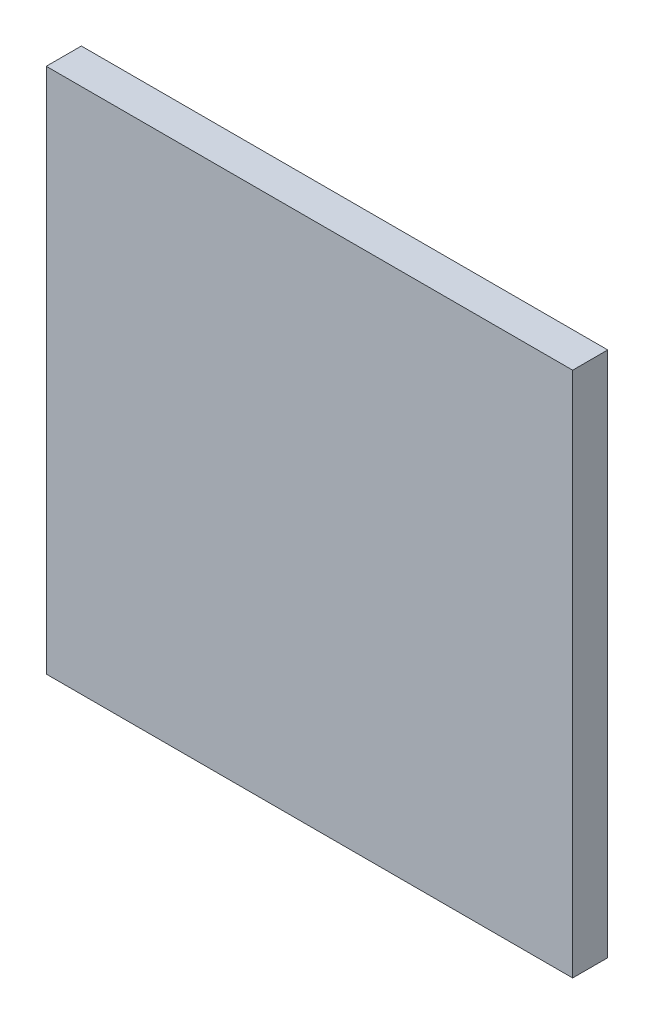
ISO-10303-21;
HEADER;
FILE_DESCRIPTION(('STEP AP214'),'2;1');
FILE_NAME('part.step','',(''),(''),'','','');
FILE_SCHEMA(('AUTOMOTIVE_DESIGN { 1 0 10303 214 1 1 1 1 }'));
ENDSEC;
DATA;
#1=APPLICATION_CONTEXT('core data for automotive mechanical design processes');
#2=APPLICATION_PROTOCOL_DEFINITION('international standard','automotive_design',2000,#1);
#3=PRODUCT_CONTEXT('',#1,'mechanical');
#4=PRODUCT('Part','Part','',(#3));
#5=PRODUCT_RELATED_PRODUCT_CATEGORY('part','',(#4));
#6=PRODUCT_DEFINITION_FORMATION('','',#4);
#7=PRODUCT_DEFINITION_CONTEXT('part definition',#1,'design');
#8=PRODUCT_DEFINITION('design','',#6,#7);
#9=PRODUCT_DEFINITION_SHAPE('','',#8);
#10=(LENGTH_UNIT() NAMED_UNIT(*) SI_UNIT(.MILLI.,.METRE.));
#11=(NAMED_UNIT(*) PLANE_ANGLE_UNIT() SI_UNIT($,.RADIAN.));
#12=(NAMED_UNIT(*) SI_UNIT($,.STERADIAN.) SOLID_ANGLE_UNIT());
#13=UNCERTAINTY_MEASURE_WITH_UNIT(LENGTH_MEASURE(1.E-05),#10,'distance_accuracy_value','');
#14=(GEOMETRIC_REPRESENTATION_CONTEXT(3) GLOBAL_UNCERTAINTY_ASSIGNED_CONTEXT((#13)) GLOBAL_UNIT_ASSIGNED_CONTEXT((#10,
#11,#12)) REPRESENTATION_CONTEXT('',''));
#15=CARTESIAN_POINT('',(0.,0.,0.));
#16=DIRECTION('',(0.,0.,1.));
#17=DIRECTION('',(1.,0.,0.));
#18=AXIS2_PLACEMENT_3D('',#15,#16,#17);
#19=CARTESIAN_POINT('',(0.,0.,-20.));
#20=DIRECTION('',(-1.,0.,0.));
#21=DIRECTION('',(0.,-1.,0.));
#22=AXIS2_PLACEMENT_3D('',#19,#20,#21);
#23=PLANE('',#22);
#24=DIRECTION('',(0.,-1.,0.));
#25=VECTOR('',#24,1.);
#26=CARTESIAN_POINT('',(0.,0.,0.));
#27=LINE('',#26,#25);
#28=CARTESIAN_POINT('',(0.,0.,0.));
#29=VERTEX_POINT('',#28);
#30=CARTESIAN_POINT('',(0.,-300.,0.));
#31=VERTEX_POINT('',#30);
#32=EDGE_CURVE('E102',#29,#31,#27,.T.);
#33=ORIENTED_EDGE('',*,*,#32,.F.);
#34=DIRECTION('',(0.,0.,1.));
#35=VECTOR('',#34,1.);
#36=CARTESIAN_POINT('',(0.,0.,-20.));
#37=LINE('',#36,#35);
#38=CARTESIAN_POINT('',(0.,0.,-20.));
#39=VERTEX_POINT('',#38);
#40=EDGE_CURVE('E11',#39,#29,#37,.T.);
#41=ORIENTED_EDGE('',*,*,#40,.F.);
#42=DIRECTION('',(0.,-1.,0.));
#43=VECTOR('',#42,1.);
#44=CARTESIAN_POINT('',(0.,0.,-20.));
#45=LINE('',#44,#43);
#46=CARTESIAN_POINT('',(0.,-300.,-20.));
#47=VERTEX_POINT('',#46);
#48=EDGE_CURVE('E96',#39,#47,#45,.T.);
#49=ORIENTED_EDGE('',*,*,#48,.T.);
#50=DIRECTION('',(0.,0.,1.));
#51=VECTOR('',#50,1.);
#52=CARTESIAN_POINT('',(0.,-300.,-20.));
#53=LINE('',#52,#51);
#54=EDGE_CURVE('E41',#47,#31,#53,.T.);
#55=ORIENTED_EDGE('',*,*,#54,.T.);
#56=EDGE_LOOP('',(#33,#41,#49,#55));
#57=FACE_BOUND('',#56,.T.);
#58=ADVANCED_FACE('F38',(#57),#23,.T.);
#59=CARTESIAN_POINT('',(0.,0.,-20.));
#60=DIRECTION('',(0.,1.,0.));
#61=DIRECTION('',(0.,0.,1.));
#62=AXIS2_PLACEMENT_3D('',#59,#60,#61);
#63=PLANE('',#62);
#64=DIRECTION('',(-1.,0.,0.));
#65=VECTOR('',#64,1.);
#66=CARTESIAN_POINT('',(0.,0.,0.));
#67=LINE('',#66,#65);
#68=CARTESIAN_POINT('',(300.,0.,0.));
#69=VERTEX_POINT('',#68);
#70=EDGE_CURVE('E98',#69,#29,#67,.T.);
#71=ORIENTED_EDGE('',*,*,#70,.F.);
#72=DIRECTION('',(0.,0.,1.));
#73=VECTOR('',#72,1.);
#74=CARTESIAN_POINT('',(300.,0.,-20.));
#75=LINE('',#74,#73);
#76=CARTESIAN_POINT('',(300.,0.,-20.));
#77=VERTEX_POINT('',#76);
#78=EDGE_CURVE('E47',#77,#69,#75,.T.);
#79=ORIENTED_EDGE('',*,*,#78,.F.);
#80=DIRECTION('',(-1.,0.,0.));
#81=VECTOR('',#80,1.);
#82=CARTESIAN_POINT('',(0.,0.,-20.));
#83=LINE('',#82,#81);
#84=EDGE_CURVE('E93',#77,#39,#83,.T.);
#85=ORIENTED_EDGE('',*,*,#84,.T.);
#86=ORIENTED_EDGE('',*,*,#40,.T.);
#87=EDGE_LOOP('',(#71,#79,#85,#86));
#88=FACE_BOUND('',#87,.T.);
#89=ADVANCED_FACE('F112',(#88),#63,.T.);
#90=CARTESIAN_POINT('',(300.,0.,-20.));
#91=DIRECTION('',(1.,0.,0.));
#92=DIRECTION('',(0.,1.,0.));
#93=AXIS2_PLACEMENT_3D('',#90,#91,#92);
#94=PLANE('',#93);
#95=DIRECTION('',(0.,1.,0.));
#96=VECTOR('',#95,1.);
#97=CARTESIAN_POINT('',(300.,0.,0.));
#98=LINE('',#97,#96);
#99=CARTESIAN_POINT('',(300.,-300.,0.));
#100=VERTEX_POINT('',#99);
#101=EDGE_CURVE('E88',#100,#69,#98,.T.);
#102=ORIENTED_EDGE('',*,*,#101,.F.);
#103=DIRECTION('',(0.,0.,1.));
#104=VECTOR('',#103,1.);
#105=CARTESIAN_POINT('',(300.,-300.,-20.));
#106=LINE('',#105,#104);
#107=CARTESIAN_POINT('',(300.,-300.,-20.));
#108=VERTEX_POINT('',#107);
#109=EDGE_CURVE('E83',#108,#100,#106,.T.);
#110=ORIENTED_EDGE('',*,*,#109,.F.);
#111=DIRECTION('',(0.,1.,0.));
#112=VECTOR('',#111,1.);
#113=CARTESIAN_POINT('',(300.,0.,-20.));
#114=LINE('',#113,#112);
#115=EDGE_CURVE('E86',#108,#77,#114,.T.);
#116=ORIENTED_EDGE('',*,*,#115,.T.);
#117=ORIENTED_EDGE('',*,*,#78,.T.);
#118=EDGE_LOOP('',(#102,#110,#116,#117));
#119=FACE_BOUND('',#118,.T.);
#120=ADVANCED_FACE('F85',(#119),#94,.T.);
#121=CARTESIAN_POINT('',(0.,-300.,-20.));
#122=DIRECTION('',(0.,-1.,0.));
#123=DIRECTION('',(0.,0.,-1.));
#124=AXIS2_PLACEMENT_3D('',#121,#122,#123);
#125=PLANE('',#124);
#126=DIRECTION('',(1.,0.,0.));
#127=VECTOR('',#126,1.);
#128=CARTESIAN_POINT('',(0.,-300.,0.));
#129=LINE('',#128,#127);
#130=EDGE_CURVE('E105',#31,#100,#129,.T.);
#131=ORIENTED_EDGE('',*,*,#130,.F.);
#132=ORIENTED_EDGE('',*,*,#54,.F.);
#133=DIRECTION('',(1.,0.,0.));
#134=VECTOR('',#133,1.);
#135=CARTESIAN_POINT('',(0.,-300.,-20.));
#136=LINE('',#135,#134);
#137=EDGE_CURVE('E92',#47,#108,#136,.T.);
#138=ORIENTED_EDGE('',*,*,#137,.T.);
#139=ORIENTED_EDGE('',*,*,#109,.T.);
#140=EDGE_LOOP('',(#131,#132,#138,#139));
#141=FACE_BOUND('',#140,.T.);
#142=ADVANCED_FACE('F95',(#141),#125,.T.);
#143=CARTESIAN_POINT('',(0.,0.,-20.));
#144=DIRECTION('',(0.,0.,1.));
#145=DIRECTION('',(1.,0.,0.));
#146=AXIS2_PLACEMENT_3D('',#143,#144,#145);
#147=PLANE('',#146);
#148=ORIENTED_EDGE('',*,*,#48,.F.);
#149=ORIENTED_EDGE('',*,*,#84,.F.);
#150=ORIENTED_EDGE('',*,*,#115,.F.);
#151=ORIENTED_EDGE('',*,*,#137,.F.);
#152=EDGE_LOOP('',(#148,#149,#150,#151));
#153=FACE_BOUND('',#152,.T.);
#154=ADVANCED_FACE('F91',(#153),#147,.F.);
#155=CARTESIAN_POINT('',(0.,0.,0.));
#156=DIRECTION('',(0.,0.,1.));
#157=DIRECTION('',(1.,0.,0.));
#158=AXIS2_PLACEMENT_3D('',#155,#156,#157);
#159=PLANE('',#158);
#160=ORIENTED_EDGE('',*,*,#32,.T.);
#161=ORIENTED_EDGE('',*,*,#130,.T.);
#162=ORIENTED_EDGE('',*,*,#101,.T.);
#163=ORIENTED_EDGE('',*,*,#70,.T.);
#164=EDGE_LOOP('',(#160,#161,#162,#163));
#165=FACE_BOUND('',#164,.T.);
#166=ADVANCED_FACE('F111',(#165),#159,.T.);
#167=CLOSED_SHELL('',(#58,#89,#120,#142,#154,#166));
#168=MANIFOLD_SOLID_BREP('B2',#167);
#169=ADVANCED_BREP_SHAPE_REPRESENTATION('',(#18,#168),#14);
#170=SHAPE_DEFINITION_REPRESENTATION(#9,#169);
ENDSEC;
END-ISO-10303-21;
